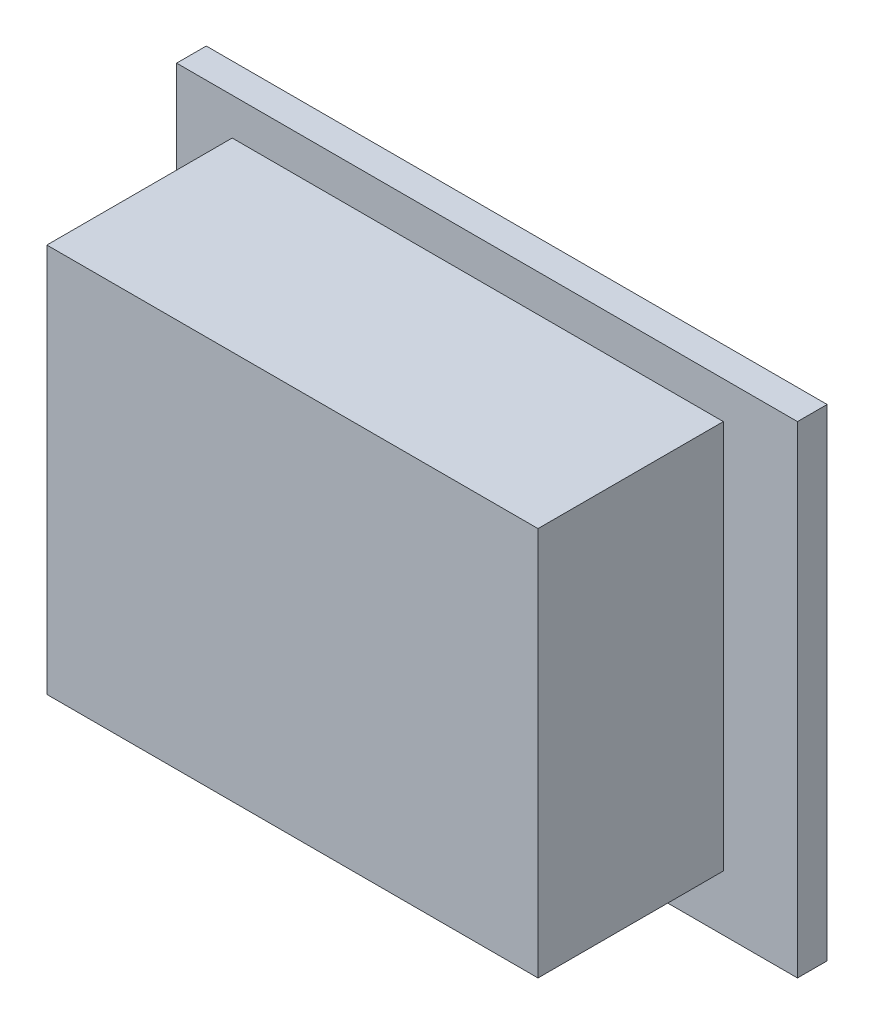
ISO-10303-21;
HEADER;
FILE_DESCRIPTION(('STEP AP214'),'2;1');
FILE_NAME('part.step','',(''),(''),'','','');
FILE_SCHEMA(('AUTOMOTIVE_DESIGN { 1 0 10303 214 1 1 1 1 }'));
ENDSEC;
DATA;
#1=APPLICATION_CONTEXT('core data for automotive mechanical design processes');
#2=APPLICATION_PROTOCOL_DEFINITION('international standard','automotive_design',2000,#1);
#3=PRODUCT_CONTEXT('',#1,'mechanical');
#4=PRODUCT('Part','Part','',(#3));
#5=PRODUCT_RELATED_PRODUCT_CATEGORY('part','',(#4));
#6=PRODUCT_DEFINITION_FORMATION('','',#4);
#7=PRODUCT_DEFINITION_CONTEXT('part definition',#1,'design');
#8=PRODUCT_DEFINITION('design','',#6,#7);
#9=PRODUCT_DEFINITION_SHAPE('','',#8);
#10=(LENGTH_UNIT() NAMED_UNIT(*) SI_UNIT(.MILLI.,.METRE.));
#11=(NAMED_UNIT(*) PLANE_ANGLE_UNIT() SI_UNIT($,.RADIAN.));
#12=(NAMED_UNIT(*) SI_UNIT($,.STERADIAN.) SOLID_ANGLE_UNIT());
#13=UNCERTAINTY_MEASURE_WITH_UNIT(LENGTH_MEASURE(1.E-05),#10,'distance_accuracy_value','');
#14=(GEOMETRIC_REPRESENTATION_CONTEXT(3) GLOBAL_UNCERTAINTY_ASSIGNED_CONTEXT((#13)) GLOBAL_UNIT_ASSIGNED_CONTEXT((#10,
#11,#12)) REPRESENTATION_CONTEXT('',''));
#15=CARTESIAN_POINT('',(0.,0.,0.));
#16=DIRECTION('',(0.,0.,1.));
#17=DIRECTION('',(1.,0.,0.));
#18=AXIS2_PLACEMENT_3D('',#15,#16,#17);
#19=CARTESIAN_POINT('',(0.,0.,1.6));
#20=DIRECTION('',(0.,0.,-1.));
#21=DIRECTION('',(-1.,0.,0.));
#22=AXIS2_PLACEMENT_3D('',#19,#20,#21);
#23=PLANE('',#22);
#24=DIRECTION('',(0.,-1.,0.));
#25=VECTOR('',#24,1.);
#26=CARTESIAN_POINT('',(0.,0.,1.6));
#27=LINE('',#26,#25);
#28=CARTESIAN_POINT('',(0.,26.,1.6));
#29=VERTEX_POINT('',#28);
#30=CARTESIAN_POINT('',(0.,0.,1.6));
#31=VERTEX_POINT('',#30);
#32=EDGE_CURVE('E128',#29,#31,#27,.T.);
#33=ORIENTED_EDGE('',*,*,#32,.T.);
#34=DIRECTION('',(1.,0.,0.));
#35=VECTOR('',#34,1.);
#36=CARTESIAN_POINT('',(0.,0.,1.6));
#37=LINE('',#36,#35);
#38=CARTESIAN_POINT('',(33.5,0.,1.6));
#39=VERTEX_POINT('',#38);
#40=EDGE_CURVE('E131',#31,#39,#37,.T.);
#41=ORIENTED_EDGE('',*,*,#40,.T.);
#42=DIRECTION('',(0.,1.,0.));
#43=VECTOR('',#42,1.);
#44=CARTESIAN_POINT('',(33.5,0.,1.6));
#45=LINE('',#44,#43);
#46=CARTESIAN_POINT('',(33.5,26.,1.6));
#47=VERTEX_POINT('',#46);
#48=EDGE_CURVE('E134',#39,#47,#45,.T.);
#49=ORIENTED_EDGE('',*,*,#48,.T.);
#50=DIRECTION('',(-1.,0.,0.));
#51=VECTOR('',#50,1.);
#52=CARTESIAN_POINT('',(0.,26.,1.6));
#53=LINE('',#52,#51);
#54=EDGE_CURVE('E136',#47,#29,#53,.T.);
#55=ORIENTED_EDGE('',*,*,#54,.T.);
#56=EDGE_LOOP('',(#33,#41,#49,#55));
#57=FACE_BOUND('',#56,.T.);
#58=DIRECTION('',(0.,-1.,0.));
#59=VECTOR('',#58,1.);
#60=CARTESIAN_POINT('',(3.,3.,1.6));
#61=LINE('',#60,#59);
#62=CARTESIAN_POINT('',(3.,24.,1.6));
#63=VERTEX_POINT('',#62);
#64=CARTESIAN_POINT('',(3.,3.,1.6));
#65=VERTEX_POINT('',#64);
#66=EDGE_CURVE('E118',#63,#65,#61,.T.);
#67=ORIENTED_EDGE('',*,*,#66,.F.);
#68=DIRECTION('',(-1.,0.,0.));
#69=VECTOR('',#68,1.);
#70=CARTESIAN_POINT('',(3.,24.,1.6));
#71=LINE('',#70,#69);
#72=CARTESIAN_POINT('',(29.5,24.,1.6));
#73=VERTEX_POINT('',#72);
#74=EDGE_CURVE('E115',#73,#63,#71,.T.);
#75=ORIENTED_EDGE('',*,*,#74,.F.);
#76=DIRECTION('',(0.,1.,0.));
#77=VECTOR('',#76,1.);
#78=CARTESIAN_POINT('',(29.5,3.,1.6));
#79=LINE('',#78,#77);
#80=CARTESIAN_POINT('',(29.5,3.,1.6));
#81=VERTEX_POINT('',#80);
#82=EDGE_CURVE('E53',#81,#73,#79,.T.);
#83=ORIENTED_EDGE('',*,*,#82,.F.);
#84=DIRECTION('',(1.,0.,0.));
#85=VECTOR('',#84,1.);
#86=CARTESIAN_POINT('',(3.,3.,1.6));
#87=LINE('',#86,#85);
#88=EDGE_CURVE('E48',#65,#81,#87,.T.);
#89=ORIENTED_EDGE('',*,*,#88,.F.);
#90=EDGE_LOOP('',(#67,#75,#83,#89));
#91=FACE_BOUND('',#90,.T.);
#92=ADVANCED_FACE('F33',(#57,#91),#23,.F.);
#93=CARTESIAN_POINT('',(0.,0.,1.6));
#94=DIRECTION('',(1.,0.,0.));
#95=DIRECTION('',(0.,0.,-1.));
#96=AXIS2_PLACEMENT_3D('',#93,#94,#95);
#97=PLANE('',#96);
#98=DIRECTION('',(0.,-1.,0.));
#99=VECTOR('',#98,1.);
#100=CARTESIAN_POINT('',(0.,0.,0.));
#101=LINE('',#100,#99);
#102=CARTESIAN_POINT('',(0.,26.,0.));
#103=VERTEX_POINT('',#102);
#104=CARTESIAN_POINT('',(0.,0.,0.));
#105=VERTEX_POINT('',#104);
#106=EDGE_CURVE('E119',#103,#105,#101,.T.);
#107=ORIENTED_EDGE('',*,*,#106,.T.);
#108=DIRECTION('',(0.,0.,-1.));
#109=VECTOR('',#108,1.);
#110=CARTESIAN_POINT('',(0.,0.,1.6));
#111=LINE('',#110,#109);
#112=EDGE_CURVE('E11',#31,#105,#111,.T.);
#113=ORIENTED_EDGE('',*,*,#112,.F.);
#114=ORIENTED_EDGE('',*,*,#32,.F.);
#115=DIRECTION('',(0.,0.,-1.));
#116=VECTOR('',#115,1.);
#117=CARTESIAN_POINT('',(0.,26.,1.6));
#118=LINE('',#117,#116);
#119=EDGE_CURVE('E137',#29,#103,#118,.T.);
#120=ORIENTED_EDGE('',*,*,#119,.T.);
#121=EDGE_LOOP('',(#107,#113,#114,#120));
#122=FACE_BOUND('',#121,.T.);
#123=ADVANCED_FACE('F35',(#122),#97,.F.);
#124=CARTESIAN_POINT('',(0.,0.,1.6));
#125=DIRECTION('',(0.,1.,0.));
#126=DIRECTION('',(0.,0.,1.));
#127=AXIS2_PLACEMENT_3D('',#124,#125,#126);
#128=PLANE('',#127);
#129=DIRECTION('',(1.,0.,0.));
#130=VECTOR('',#129,1.);
#131=CARTESIAN_POINT('',(0.,0.,0.));
#132=LINE('',#131,#130);
#133=CARTESIAN_POINT('',(33.5,0.,0.));
#134=VERTEX_POINT('',#133);
#135=EDGE_CURVE('E122',#105,#134,#132,.T.);
#136=ORIENTED_EDGE('',*,*,#135,.T.);
#137=DIRECTION('',(0.,0.,-1.));
#138=VECTOR('',#137,1.);
#139=CARTESIAN_POINT('',(33.5,0.,1.6));
#140=LINE('',#139,#138);
#141=EDGE_CURVE('E41',#39,#134,#140,.T.);
#142=ORIENTED_EDGE('',*,*,#141,.F.);
#143=ORIENTED_EDGE('',*,*,#40,.F.);
#144=ORIENTED_EDGE('',*,*,#112,.T.);
#145=EDGE_LOOP('',(#136,#142,#143,#144));
#146=FACE_BOUND('',#145,.T.);
#147=ADVANCED_FACE('F167',(#146),#128,.F.);
#148=CARTESIAN_POINT('',(33.5,0.,1.6));
#149=DIRECTION('',(-1.,0.,0.));
#150=DIRECTION('',(0.,0.,1.));
#151=AXIS2_PLACEMENT_3D('',#148,#149,#150);
#152=PLANE('',#151);
#153=DIRECTION('',(0.,1.,0.));
#154=VECTOR('',#153,1.);
#155=CARTESIAN_POINT('',(33.5,0.,0.));
#156=LINE('',#155,#154);
#157=CARTESIAN_POINT('',(33.5,26.,0.));
#158=VERTEX_POINT('',#157);
#159=EDGE_CURVE('E140',#134,#158,#156,.T.);
#160=ORIENTED_EDGE('',*,*,#159,.T.);
#161=DIRECTION('',(0.,0.,-1.));
#162=VECTOR('',#161,1.);
#163=CARTESIAN_POINT('',(33.5,26.,1.6));
#164=LINE('',#163,#162);
#165=EDGE_CURVE('E145',#47,#158,#164,.T.);
#166=ORIENTED_EDGE('',*,*,#165,.F.);
#167=ORIENTED_EDGE('',*,*,#48,.F.);
#168=ORIENTED_EDGE('',*,*,#141,.T.);
#169=EDGE_LOOP('',(#160,#166,#167,#168));
#170=FACE_BOUND('',#169,.T.);
#171=ADVANCED_FACE('F152',(#170),#152,.F.);
#172=CARTESIAN_POINT('',(0.,26.,1.6));
#173=DIRECTION('',(0.,-1.,0.));
#174=DIRECTION('',(0.,0.,-1.));
#175=AXIS2_PLACEMENT_3D('',#172,#173,#174);
#176=PLANE('',#175);
#177=DIRECTION('',(-1.,0.,0.));
#178=VECTOR('',#177,1.);
#179=CARTESIAN_POINT('',(0.,26.,0.));
#180=LINE('',#179,#178);
#181=EDGE_CURVE('E132',#158,#103,#180,.T.);
#182=ORIENTED_EDGE('',*,*,#181,.T.);
#183=ORIENTED_EDGE('',*,*,#119,.F.);
#184=ORIENTED_EDGE('',*,*,#54,.F.);
#185=ORIENTED_EDGE('',*,*,#165,.T.);
#186=EDGE_LOOP('',(#182,#183,#184,#185));
#187=FACE_BOUND('',#186,.T.);
#188=ADVANCED_FACE('F161',(#187),#176,.F.);
#189=CARTESIAN_POINT('',(0.,0.,0.));
#190=DIRECTION('',(0.,0.,-1.));
#191=DIRECTION('',(-1.,0.,0.));
#192=AXIS2_PLACEMENT_3D('',#189,#190,#191);
#193=PLANE('',#192);
#194=ORIENTED_EDGE('',*,*,#106,.F.);
#195=ORIENTED_EDGE('',*,*,#181,.F.);
#196=ORIENTED_EDGE('',*,*,#159,.F.);
#197=ORIENTED_EDGE('',*,*,#135,.F.);
#198=EDGE_LOOP('',(#194,#195,#196,#197));
#199=FACE_BOUND('',#198,.T.);
#200=ADVANCED_FACE('F158',(#199),#193,.T.);
#201=CARTESIAN_POINT('',(3.,3.,11.6));
#202=DIRECTION('',(1.,0.,0.));
#203=DIRECTION('',(0.,0.,-1.));
#204=AXIS2_PLACEMENT_3D('',#201,#202,#203);
#205=PLANE('',#204);
#206=ORIENTED_EDGE('',*,*,#66,.T.);
#207=DIRECTION('',(0.,0.,-1.));
#208=VECTOR('',#207,1.);
#209=CARTESIAN_POINT('',(3.,3.,11.6));
#210=LINE('',#209,#208);
#211=CARTESIAN_POINT('',(3.,3.,11.6));
#212=VERTEX_POINT('',#211);
#213=EDGE_CURVE('E99',#212,#65,#210,.T.);
#214=ORIENTED_EDGE('',*,*,#213,.F.);
#215=DIRECTION('',(0.,-1.,0.));
#216=VECTOR('',#215,1.);
#217=CARTESIAN_POINT('',(3.,3.,11.6));
#218=LINE('',#217,#216);
#219=CARTESIAN_POINT('',(3.,24.,11.6));
#220=VERTEX_POINT('',#219);
#221=EDGE_CURVE('E106',#220,#212,#218,.T.);
#222=ORIENTED_EDGE('',*,*,#221,.F.);
#223=DIRECTION('',(0.,0.,-1.));
#224=VECTOR('',#223,1.);
#225=CARTESIAN_POINT('',(3.,24.,11.6));
#226=LINE('',#225,#224);
#227=EDGE_CURVE('E260',#220,#63,#226,.T.);
#228=ORIENTED_EDGE('',*,*,#227,.T.);
#229=EDGE_LOOP('',(#206,#214,#222,#228));
#230=FACE_BOUND('',#229,.T.);
#231=ADVANCED_FACE('F117',(#230),#205,.F.);
#232=CARTESIAN_POINT('',(3.,3.,11.6));
#233=DIRECTION('',(0.,1.,0.));
#234=DIRECTION('',(0.,0.,1.));
#235=AXIS2_PLACEMENT_3D('',#232,#233,#234);
#236=PLANE('',#235);
#237=ORIENTED_EDGE('',*,*,#88,.T.);
#238=DIRECTION('',(0.,0.,-1.));
#239=VECTOR('',#238,1.);
#240=CARTESIAN_POINT('',(29.5,3.,11.6));
#241=LINE('',#240,#239);
#242=CARTESIAN_POINT('',(29.5,3.,11.6));
#243=VERTEX_POINT('',#242);
#244=EDGE_CURVE('E102',#243,#81,#241,.T.);
#245=ORIENTED_EDGE('',*,*,#244,.F.);
#246=DIRECTION('',(1.,0.,0.));
#247=VECTOR('',#246,1.);
#248=CARTESIAN_POINT('',(3.,3.,11.6));
#249=LINE('',#248,#247);
#250=EDGE_CURVE('E95',#212,#243,#249,.T.);
#251=ORIENTED_EDGE('',*,*,#250,.F.);
#252=ORIENTED_EDGE('',*,*,#213,.T.);
#253=EDGE_LOOP('',(#237,#245,#251,#252));
#254=FACE_BOUND('',#253,.T.);
#255=ADVANCED_FACE('F97',(#254),#236,.F.);
#256=CARTESIAN_POINT('',(29.5,3.,11.6));
#257=DIRECTION('',(-1.,0.,0.));
#258=DIRECTION('',(0.,0.,1.));
#259=AXIS2_PLACEMENT_3D('',#256,#257,#258);
#260=PLANE('',#259);
#261=ORIENTED_EDGE('',*,*,#82,.T.);
#262=DIRECTION('',(0.,0.,-1.));
#263=VECTOR('',#262,1.);
#264=CARTESIAN_POINT('',(29.5,24.,11.6));
#265=LINE('',#264,#263);
#266=CARTESIAN_POINT('',(29.5,24.,11.6));
#267=VERTEX_POINT('',#266);
#268=EDGE_CURVE('E124',#267,#73,#265,.T.);
#269=ORIENTED_EDGE('',*,*,#268,.F.);
#270=DIRECTION('',(0.,1.,0.));
#271=VECTOR('',#270,1.);
#272=CARTESIAN_POINT('',(29.5,3.,11.6));
#273=LINE('',#272,#271);
#274=EDGE_CURVE('E105',#243,#267,#273,.T.);
#275=ORIENTED_EDGE('',*,*,#274,.F.);
#276=ORIENTED_EDGE('',*,*,#244,.T.);
#277=EDGE_LOOP('',(#261,#269,#275,#276));
#278=FACE_BOUND('',#277,.T.);
#279=ADVANCED_FACE('F203',(#278),#260,.F.);
#280=CARTESIAN_POINT('',(3.,24.,11.6));
#281=DIRECTION('',(0.,-1.,0.));
#282=DIRECTION('',(0.,0.,-1.));
#283=AXIS2_PLACEMENT_3D('',#280,#281,#282);
#284=PLANE('',#283);
#285=ORIENTED_EDGE('',*,*,#74,.T.);
#286=ORIENTED_EDGE('',*,*,#227,.F.);
#287=DIRECTION('',(-1.,0.,0.));
#288=VECTOR('',#287,1.);
#289=CARTESIAN_POINT('',(3.,24.,11.6));
#290=LINE('',#289,#288);
#291=EDGE_CURVE('E111',#267,#220,#290,.T.);
#292=ORIENTED_EDGE('',*,*,#291,.F.);
#293=ORIENTED_EDGE('',*,*,#268,.T.);
#294=EDGE_LOOP('',(#285,#286,#292,#293));
#295=FACE_BOUND('',#294,.T.);
#296=ADVANCED_FACE('F209',(#295),#284,.F.);
#297=CARTESIAN_POINT('',(0.,0.,11.6));
#298=DIRECTION('',(0.,0.,-1.));
#299=DIRECTION('',(-1.,0.,0.));
#300=AXIS2_PLACEMENT_3D('',#297,#298,#299);
#301=PLANE('',#300);
#302=ORIENTED_EDGE('',*,*,#221,.T.);
#303=ORIENTED_EDGE('',*,*,#250,.T.);
#304=ORIENTED_EDGE('',*,*,#274,.T.);
#305=ORIENTED_EDGE('',*,*,#291,.T.);
#306=EDGE_LOOP('',(#302,#303,#304,#305));
#307=FACE_BOUND('',#306,.T.);
#308=ADVANCED_FACE('F109',(#307),#301,.F.);
#309=CLOSED_SHELL('',(#92,#123,#147,#171,#188,#200,#231,#255,#279,#296,#308));
#310=MANIFOLD_SOLID_BREP('B2',#309);
#311=ADVANCED_BREP_SHAPE_REPRESENTATION('',(#18,#310),#14);
#312=SHAPE_DEFINITION_REPRESENTATION(#9,#311);
ENDSEC;
END-ISO-10303-21;
